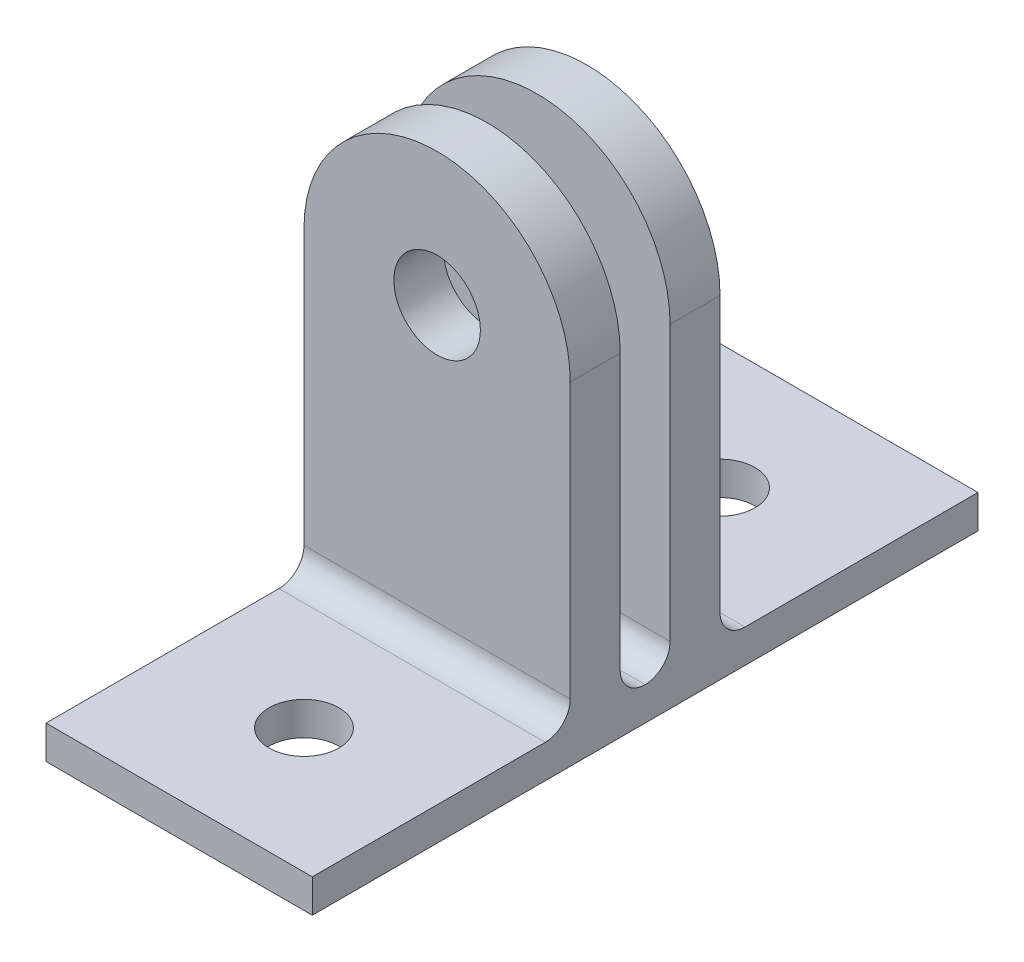
ISO-10303-21;
HEADER;
FILE_DESCRIPTION(('STEP AP214'),'2;1');
FILE_NAME('part.step','',(''),(''),'','','');
FILE_SCHEMA(('AUTOMOTIVE_DESIGN { 1 0 10303 214 1 1 1 1 }'));
ENDSEC;
DATA;
#1=APPLICATION_CONTEXT('core data for automotive mechanical design processes');
#2=APPLICATION_PROTOCOL_DEFINITION('international standard','automotive_design',2000,#1);
#3=PRODUCT_CONTEXT('',#1,'mechanical');
#4=PRODUCT('Part','Part','',(#3));
#5=PRODUCT_RELATED_PRODUCT_CATEGORY('part','',(#4));
#6=PRODUCT_DEFINITION_FORMATION('','',#4);
#7=PRODUCT_DEFINITION_CONTEXT('part definition',#1,'design');
#8=PRODUCT_DEFINITION('design','',#6,#7);
#9=PRODUCT_DEFINITION_SHAPE('','',#8);
#10=(LENGTH_UNIT() NAMED_UNIT(*) SI_UNIT(.MILLI.,.METRE.));
#11=(NAMED_UNIT(*) PLANE_ANGLE_UNIT() SI_UNIT($,.RADIAN.));
#12=(NAMED_UNIT(*) SI_UNIT($,.STERADIAN.) SOLID_ANGLE_UNIT());
#13=UNCERTAINTY_MEASURE_WITH_UNIT(LENGTH_MEASURE(1.E-05),#10,'distance_accuracy_value','');
#14=(GEOMETRIC_REPRESENTATION_CONTEXT(3) GLOBAL_UNCERTAINTY_ASSIGNED_CONTEXT((#13)) GLOBAL_UNIT_ASSIGNED_CONTEXT((#10,
#11,#12)) REPRESENTATION_CONTEXT('',''));
#15=CARTESIAN_POINT('',(0.,0.,0.));
#16=DIRECTION('',(0.,0.,1.));
#17=DIRECTION('',(1.,0.,0.));
#18=AXIS2_PLACEMENT_3D('',#15,#16,#17);
#19=CARTESIAN_POINT('',(0.,2.,0.));
#20=DIRECTION('',(0.,1.,0.));
#21=DIRECTION('',(0.,0.,1.));
#22=AXIS2_PLACEMENT_3D('',#19,#20,#21);
#23=PLANE('',#22);
#24=CARTESIAN_POINT('',(0.,2.,-12.5));
#25=DIRECTION('',(0.,1.,0.));
#26=DIRECTION('',(0.,0.,-1.));
#27=AXIS2_PLACEMENT_3D('',#24,#25,#26);
#28=CIRCLE('',#27,2.1);
#29=CARTESIAN_POINT('',(0.,2.,-14.6));
#30=VERTEX_POINT('',#29);
#31=EDGE_CURVE('E354',#30,#30,#28,.T.);
#32=ORIENTED_EDGE('',*,*,#31,.F.);
#33=EDGE_LOOP('',(#32));
#34=FACE_BOUND('',#33,.T.);
#35=DIRECTION('',(0.,0.,1.));
#36=VECTOR('',#35,1.);
#37=CARTESIAN_POINT('',(-8.,2.,20.));
#38=LINE('',#37,#36);
#39=CARTESIAN_POINT('',(-8.,2.,-20.));
#40=VERTEX_POINT('',#39);
#41=CARTESIAN_POINT('',(-8.,2.,-6.));
#42=VERTEX_POINT('',#41);
#43=EDGE_CURVE('E210',#40,#42,#38,.T.);
#44=ORIENTED_EDGE('',*,*,#43,.T.);
#45=DIRECTION('',(1.,0.,0.));
#46=VECTOR('',#45,1.);
#47=CARTESIAN_POINT('',(0.,2.,-6.));
#48=LINE('',#47,#46);
#49=CARTESIAN_POINT('',(8.,2.,-6.));
#50=VERTEX_POINT('',#49);
#51=EDGE_CURVE('E238',#42,#50,#48,.T.);
#52=ORIENTED_EDGE('',*,*,#51,.T.);
#53=DIRECTION('',(0.,0.,-1.));
#54=VECTOR('',#53,1.);
#55=CARTESIAN_POINT('',(8.,2.,-20.));
#56=LINE('',#55,#54);
#57=CARTESIAN_POINT('',(8.,2.,-20.));
#58=VERTEX_POINT('',#57);
#59=EDGE_CURVE('E207',#50,#58,#56,.T.);
#60=ORIENTED_EDGE('',*,*,#59,.T.);
#61=DIRECTION('',(-1.,0.,0.));
#62=VECTOR('',#61,1.);
#63=CARTESIAN_POINT('',(-8.,2.,-20.));
#64=LINE('',#63,#62);
#65=EDGE_CURVE('E206',#58,#40,#64,.T.);
#66=ORIENTED_EDGE('',*,*,#65,.T.);
#67=EDGE_LOOP('',(#44,#52,#60,#66));
#68=FACE_BOUND('',#67,.T.);
#69=ADVANCED_FACE('F35',(#34,#68),#23,.T.);
#70=CARTESIAN_POINT('',(8.,2.,-20.));
#71=DIRECTION('',(-1.,0.,0.));
#72=DIRECTION('',(0.,0.,1.));
#73=AXIS2_PLACEMENT_3D('',#70,#71,#72);
#74=PLANE('',#73);
#75=DIRECTION('',(0.,0.,-1.));
#76=VECTOR('',#75,1.);
#77=CARTESIAN_POINT('',(8.,0.,-20.));
#78=LINE('',#77,#76);
#79=CARTESIAN_POINT('',(8.,0.,20.));
#80=VERTEX_POINT('',#79);
#81=CARTESIAN_POINT('',(8.,0.,-20.));
#82=VERTEX_POINT('',#81);
#83=EDGE_CURVE('E202',#80,#82,#78,.T.);
#84=ORIENTED_EDGE('',*,*,#83,.T.);
#85=DIRECTION('',(0.,-1.,0.));
#86=VECTOR('',#85,1.);
#87=CARTESIAN_POINT('',(8.,2.,-20.));
#88=LINE('',#87,#86);
#89=EDGE_CURVE('E232',#58,#82,#88,.T.);
#90=ORIENTED_EDGE('',*,*,#89,.F.);
#91=ORIENTED_EDGE('',*,*,#59,.F.);
#92=CARTESIAN_POINT('',(8.,3.5,-6.));
#93=DIRECTION('',(-1.,0.,0.));
#94=DIRECTION('',(0.,0.,1.));
#95=AXIS2_PLACEMENT_3D('',#92,#93,#94);
#96=CIRCLE('',#95,1.5);
#97=CARTESIAN_POINT('',(8.,3.5,-4.5));
#98=VERTEX_POINT('',#97);
#99=EDGE_CURVE('E252',#50,#98,#96,.T.);
#100=ORIENTED_EDGE('',*,*,#99,.T.);
#101=DIRECTION('',(0.,1.,0.));
#102=VECTOR('',#101,1.);
#103=CARTESIAN_POINT('',(8.,20.,-4.5));
#104=LINE('',#103,#102);
#105=CARTESIAN_POINT('',(8.,20.,-4.5));
#106=VERTEX_POINT('',#105);
#107=EDGE_CURVE('E167',#98,#106,#104,.T.);
#108=ORIENTED_EDGE('',*,*,#107,.T.);
#109=DIRECTION('',(0.,0.,1.));
#110=VECTOR('',#109,1.);
#111=CARTESIAN_POINT('',(8.,20.,-4.5));
#112=LINE('',#111,#110);
#113=CARTESIAN_POINT('',(8.,20.,-1.5));
#114=VERTEX_POINT('',#113);
#115=EDGE_CURVE('E153',#106,#114,#112,.T.);
#116=ORIENTED_EDGE('',*,*,#115,.T.);
#117=DIRECTION('',(0.,1.,0.));
#118=VECTOR('',#117,1.);
#119=CARTESIAN_POINT('',(8.,20.,-1.5));
#120=LINE('',#119,#118);
#121=CARTESIAN_POINT('',(8.,3.5,-1.5));
#122=VERTEX_POINT('',#121);
#123=EDGE_CURVE('E162',#122,#114,#120,.T.);
#124=ORIENTED_EDGE('',*,*,#123,.F.);
#125=CARTESIAN_POINT('',(8.,3.5,0.));
#126=DIRECTION('',(-1.,0.,0.));
#127=DIRECTION('',(0.,0.,1.));
#128=AXIS2_PLACEMENT_3D('',#125,#126,#127);
#129=CIRCLE('',#128,1.5);
#130=CARTESIAN_POINT('',(8.,2.,0.));
#131=VERTEX_POINT('',#130);
#132=EDGE_CURVE('E57',#122,#131,#129,.T.);
#133=ORIENTED_EDGE('',*,*,#132,.T.);
#134=CARTESIAN_POINT('',(8.,3.5,0.));
#135=DIRECTION('',(-1.,0.,0.));
#136=DIRECTION('',(0.,0.,1.));
#137=AXIS2_PLACEMENT_3D('',#134,#135,#136);
#138=CIRCLE('',#137,1.5);
#139=CARTESIAN_POINT('',(8.,3.5,1.5));
#140=VERTEX_POINT('',#139);
#141=EDGE_CURVE('E44',#131,#140,#138,.T.);
#142=ORIENTED_EDGE('',*,*,#141,.T.);
#143=DIRECTION('',(0.,1.,0.));
#144=VECTOR('',#143,1.);
#145=CARTESIAN_POINT('',(8.,20.,1.5));
#146=LINE('',#145,#144);
#147=CARTESIAN_POINT('',(8.,20.,1.5));
#148=VERTEX_POINT('',#147);
#149=EDGE_CURVE('E194',#140,#148,#146,.T.);
#150=ORIENTED_EDGE('',*,*,#149,.T.);
#151=DIRECTION('',(0.,0.,-1.));
#152=VECTOR('',#151,1.);
#153=CARTESIAN_POINT('',(8.,20.,4.5));
#154=LINE('',#153,#152);
#155=CARTESIAN_POINT('',(8.,20.,4.5));
#156=VERTEX_POINT('',#155);
#157=EDGE_CURVE('E199',#156,#148,#154,.T.);
#158=ORIENTED_EDGE('',*,*,#157,.F.);
#159=DIRECTION('',(0.,1.,0.));
#160=VECTOR('',#159,1.);
#161=CARTESIAN_POINT('',(8.,20.,4.5));
#162=LINE('',#161,#160);
#163=CARTESIAN_POINT('',(8.,3.5,4.5));
#164=VERTEX_POINT('',#163);
#165=EDGE_CURVE('E187',#164,#156,#162,.T.);
#166=ORIENTED_EDGE('',*,*,#165,.F.);
#167=CARTESIAN_POINT('',(8.,3.5,6.));
#168=DIRECTION('',(-1.,0.,0.));
#169=DIRECTION('',(0.,0.,1.));
#170=AXIS2_PLACEMENT_3D('',#167,#168,#169);
#171=CIRCLE('',#170,1.5);
#172=CARTESIAN_POINT('',(8.,2.,6.));
#173=VERTEX_POINT('',#172);
#174=EDGE_CURVE('E256',#164,#173,#171,.T.);
#175=ORIENTED_EDGE('',*,*,#174,.T.);
#176=CARTESIAN_POINT('',(8.,2.,20.));
#177=VERTEX_POINT('',#176);
#178=EDGE_CURVE('E203',#177,#173,#56,.T.);
#179=ORIENTED_EDGE('',*,*,#178,.F.);
#180=DIRECTION('',(0.,-1.,0.));
#181=VECTOR('',#180,1.);
#182=CARTESIAN_POINT('',(8.,2.,20.));
#183=LINE('',#182,#181);
#184=EDGE_CURVE('E215',#177,#80,#183,.T.);
#185=ORIENTED_EDGE('',*,*,#184,.T.);
#186=EDGE_LOOP('',(#84,#90,#91,#100,#108,#116,#124,#133,#142,#150,#158,#166,#175,#179,#185));
#187=FACE_BOUND('',#186,.T.);
#188=ADVANCED_FACE('F261',(#187),#74,.F.);
#189=CARTESIAN_POINT('',(-8.,2.,-20.));
#190=DIRECTION('',(0.,0.,1.));
#191=DIRECTION('',(1.,0.,0.));
#192=AXIS2_PLACEMENT_3D('',#189,#190,#191);
#193=PLANE('',#192);
#194=DIRECTION('',(-1.,0.,0.));
#195=VECTOR('',#194,1.);
#196=CARTESIAN_POINT('',(-8.,0.,-20.));
#197=LINE('',#196,#195);
#198=CARTESIAN_POINT('',(-8.,0.,-20.));
#199=VERTEX_POINT('',#198);
#200=EDGE_CURVE('E218',#82,#199,#197,.T.);
#201=ORIENTED_EDGE('',*,*,#200,.T.);
#202=DIRECTION('',(0.,-1.,0.));
#203=VECTOR('',#202,1.);
#204=CARTESIAN_POINT('',(-8.,2.,-20.));
#205=LINE('',#204,#203);
#206=EDGE_CURVE('E229',#40,#199,#205,.T.);
#207=ORIENTED_EDGE('',*,*,#206,.F.);
#208=ORIENTED_EDGE('',*,*,#65,.F.);
#209=ORIENTED_EDGE('',*,*,#89,.T.);
#210=EDGE_LOOP('',(#201,#207,#208,#209));
#211=FACE_BOUND('',#210,.T.);
#212=ADVANCED_FACE('F290',(#211),#193,.F.);
#213=CARTESIAN_POINT('',(-8.,2.,20.));
#214=DIRECTION('',(1.,0.,0.));
#215=DIRECTION('',(0.,0.,-1.));
#216=AXIS2_PLACEMENT_3D('',#213,#214,#215);
#217=PLANE('',#216);
#218=DIRECTION('',(0.,0.,1.));
#219=VECTOR('',#218,1.);
#220=CARTESIAN_POINT('',(-8.,0.,20.));
#221=LINE('',#220,#219);
#222=CARTESIAN_POINT('',(-8.,0.,20.));
#223=VERTEX_POINT('',#222);
#224=EDGE_CURVE('E220',#199,#223,#221,.T.);
#225=ORIENTED_EDGE('',*,*,#224,.T.);
#226=DIRECTION('',(0.,-1.,0.));
#227=VECTOR('',#226,1.);
#228=CARTESIAN_POINT('',(-8.,2.,20.));
#229=LINE('',#228,#227);
#230=CARTESIAN_POINT('',(-8.,2.,20.));
#231=VERTEX_POINT('',#230);
#232=EDGE_CURVE('E226',#231,#223,#229,.T.);
#233=ORIENTED_EDGE('',*,*,#232,.F.);
#234=CARTESIAN_POINT('',(-8.,2.,6.));
#235=VERTEX_POINT('',#234);
#236=EDGE_CURVE('E209',#235,#231,#38,.T.);
#237=ORIENTED_EDGE('',*,*,#236,.F.);
#238=CARTESIAN_POINT('',(-8.,3.5,6.));
#239=DIRECTION('',(1.,0.,0.));
#240=DIRECTION('',(0.,0.,-1.));
#241=AXIS2_PLACEMENT_3D('',#238,#239,#240);
#242=CIRCLE('',#241,1.5);
#243=CARTESIAN_POINT('',(-8.,3.5,4.5));
#244=VERTEX_POINT('',#243);
#245=EDGE_CURVE('E258',#235,#244,#242,.T.);
#246=ORIENTED_EDGE('',*,*,#245,.T.);
#247=DIRECTION('',(0.,-1.,0.));
#248=VECTOR('',#247,1.);
#249=CARTESIAN_POINT('',(-8.,20.,4.5));
#250=LINE('',#249,#248);
#251=CARTESIAN_POINT('',(-8.,20.,4.5));
#252=VERTEX_POINT('',#251);
#253=EDGE_CURVE('E184',#252,#244,#250,.T.);
#254=ORIENTED_EDGE('',*,*,#253,.F.);
#255=DIRECTION('',(0.,0.,-1.));
#256=VECTOR('',#255,1.);
#257=CARTESIAN_POINT('',(-8.,20.,4.5));
#258=LINE('',#257,#256);
#259=CARTESIAN_POINT('',(-8.,20.,1.5));
#260=VERTEX_POINT('',#259);
#261=EDGE_CURVE('E192',#252,#260,#258,.T.);
#262=ORIENTED_EDGE('',*,*,#261,.T.);
#263=DIRECTION('',(0.,-1.,0.));
#264=VECTOR('',#263,1.);
#265=CARTESIAN_POINT('',(-8.,20.,1.5));
#266=LINE('',#265,#264);
#267=CARTESIAN_POINT('',(-8.,3.5,1.5));
#268=VERTEX_POINT('',#267);
#269=EDGE_CURVE('E181',#260,#268,#266,.T.);
#270=ORIENTED_EDGE('',*,*,#269,.T.);
#271=CARTESIAN_POINT('',(-8.,3.5,0.));
#272=DIRECTION('',(1.,0.,0.));
#273=DIRECTION('',(0.,0.,-1.));
#274=AXIS2_PLACEMENT_3D('',#271,#272,#273);
#275=CIRCLE('',#274,1.5);
#276=CARTESIAN_POINT('',(-8.,2.,0.));
#277=VERTEX_POINT('',#276);
#278=EDGE_CURVE('E11',#268,#277,#275,.T.);
#279=ORIENTED_EDGE('',*,*,#278,.T.);
#280=CARTESIAN_POINT('',(-8.,3.5,0.));
#281=DIRECTION('',(1.,0.,0.));
#282=DIRECTION('',(0.,0.,-1.));
#283=AXIS2_PLACEMENT_3D('',#280,#281,#282);
#284=CIRCLE('',#283,1.5);
#285=CARTESIAN_POINT('',(-8.,3.5,-1.5));
#286=VERTEX_POINT('',#285);
#287=EDGE_CURVE('E250',#277,#286,#284,.T.);
#288=ORIENTED_EDGE('',*,*,#287,.T.);
#289=DIRECTION('',(0.,-1.,0.));
#290=VECTOR('',#289,1.);
#291=CARTESIAN_POINT('',(-8.,20.,-1.5));
#292=LINE('',#291,#290);
#293=CARTESIAN_POINT('',(-8.,20.,-1.5));
#294=VERTEX_POINT('',#293);
#295=EDGE_CURVE('E147',#294,#286,#292,.T.);
#296=ORIENTED_EDGE('',*,*,#295,.F.);
#297=DIRECTION('',(0.,0.,1.));
#298=VECTOR('',#297,1.);
#299=CARTESIAN_POINT('',(-8.,20.,-4.5));
#300=LINE('',#299,#298);
#301=CARTESIAN_POINT('',(-8.,20.,-4.5));
#302=VERTEX_POINT('',#301);
#303=EDGE_CURVE('E141',#302,#294,#300,.T.);
#304=ORIENTED_EDGE('',*,*,#303,.F.);
#305=DIRECTION('',(0.,-1.,0.));
#306=VECTOR('',#305,1.);
#307=CARTESIAN_POINT('',(-8.,20.,-4.5));
#308=LINE('',#307,#306);
#309=CARTESIAN_POINT('',(-8.,3.5,-4.5));
#310=VERTEX_POINT('',#309);
#311=EDGE_CURVE('E144',#302,#310,#308,.T.);
#312=ORIENTED_EDGE('',*,*,#311,.T.);
#313=CARTESIAN_POINT('',(-8.,3.5,-6.));
#314=DIRECTION('',(1.,0.,0.));
#315=DIRECTION('',(0.,0.,-1.));
#316=AXIS2_PLACEMENT_3D('',#313,#314,#315);
#317=CIRCLE('',#316,1.5);
#318=EDGE_CURVE('E254',#310,#42,#317,.T.);
#319=ORIENTED_EDGE('',*,*,#318,.T.);
#320=ORIENTED_EDGE('',*,*,#43,.F.);
#321=ORIENTED_EDGE('',*,*,#206,.T.);
#322=EDGE_LOOP('',(#225,#233,#237,#246,#254,#262,#270,#279,#288,#296,#304,#312,#319,#320,#321));
#323=FACE_BOUND('',#322,.T.);
#324=ADVANCED_FACE('F143',(#323),#217,.F.);
#325=CARTESIAN_POINT('',(-8.,2.,20.));
#326=DIRECTION('',(0.,0.,-1.));
#327=DIRECTION('',(-1.,0.,0.));
#328=AXIS2_PLACEMENT_3D('',#325,#326,#327);
#329=PLANE('',#328);
#330=DIRECTION('',(1.,0.,0.));
#331=VECTOR('',#330,1.);
#332=CARTESIAN_POINT('',(-8.,0.,20.));
#333=LINE('',#332,#331);
#334=EDGE_CURVE('E222',#223,#80,#333,.T.);
#335=ORIENTED_EDGE('',*,*,#334,.T.);
#336=ORIENTED_EDGE('',*,*,#184,.F.);
#337=DIRECTION('',(1.,0.,0.));
#338=VECTOR('',#337,1.);
#339=CARTESIAN_POINT('',(-8.,2.,20.));
#340=LINE('',#339,#338);
#341=EDGE_CURVE('E213',#231,#177,#340,.T.);
#342=ORIENTED_EDGE('',*,*,#341,.F.);
#343=ORIENTED_EDGE('',*,*,#232,.T.);
#344=EDGE_LOOP('',(#335,#336,#342,#343));
#345=FACE_BOUND('',#344,.T.);
#346=ADVANCED_FACE('F299',(#345),#329,.F.);
#347=CARTESIAN_POINT('',(0.,2.,12.5));
#348=DIRECTION('',(0.,1.,0.));
#349=DIRECTION('',(0.,0.,1.));
#350=AXIS2_PLACEMENT_3D('',#347,#348,#349);
#351=CIRCLE('',#350,2.1);
#352=CARTESIAN_POINT('',(0.,2.,14.6));
#353=VERTEX_POINT('',#352);
#354=EDGE_CURVE('E347',#353,#353,#351,.T.);
#355=ORIENTED_EDGE('',*,*,#354,.F.);
#356=EDGE_LOOP('',(#355));
#357=FACE_BOUND('',#356,.T.);
#358=ORIENTED_EDGE('',*,*,#178,.T.);
#359=DIRECTION('',(1.,0.,0.));
#360=VECTOR('',#359,1.);
#361=CARTESIAN_POINT('',(0.,2.,6.));
#362=LINE('',#361,#360);
#363=EDGE_CURVE('E245',#173,#235,#362,.F.);
#364=ORIENTED_EDGE('',*,*,#363,.T.);
#365=ORIENTED_EDGE('',*,*,#236,.T.);
#366=ORIENTED_EDGE('',*,*,#341,.T.);
#367=EDGE_LOOP('',(#358,#364,#365,#366));
#368=FACE_BOUND('',#367,.T.);
#369=ADVANCED_FACE('F305',(#357,#368),#23,.T.);
#370=CARTESIAN_POINT('',(0.,0.,0.));
#371=DIRECTION('',(0.,1.,0.));
#372=DIRECTION('',(0.,0.,1.));
#373=AXIS2_PLACEMENT_3D('',#370,#371,#372);
#374=PLANE('',#373);
#375=CARTESIAN_POINT('',(0.,0.,-12.5));
#376=DIRECTION('',(0.,1.,0.));
#377=DIRECTION('',(0.,0.,-1.));
#378=AXIS2_PLACEMENT_3D('',#375,#376,#377);
#379=CIRCLE('',#378,2.1);
#380=CARTESIAN_POINT('',(0.,0.,-14.6));
#381=VERTEX_POINT('',#380);
#382=EDGE_CURVE('E349',#381,#381,#379,.T.);
#383=ORIENTED_EDGE('',*,*,#382,.T.);
#384=EDGE_LOOP('',(#383));
#385=FACE_BOUND('',#384,.T.);
#386=CARTESIAN_POINT('',(0.,0.,12.5));
#387=DIRECTION('',(0.,1.,0.));
#388=DIRECTION('',(0.,0.,1.));
#389=AXIS2_PLACEMENT_3D('',#386,#387,#388);
#390=CIRCLE('',#389,2.1);
#391=CARTESIAN_POINT('',(0.,0.,14.6));
#392=VERTEX_POINT('',#391);
#393=EDGE_CURVE('E275',#392,#392,#390,.T.);
#394=ORIENTED_EDGE('',*,*,#393,.T.);
#395=EDGE_LOOP('',(#394));
#396=FACE_BOUND('',#395,.T.);
#397=ORIENTED_EDGE('',*,*,#83,.F.);
#398=ORIENTED_EDGE('',*,*,#334,.F.);
#399=ORIENTED_EDGE('',*,*,#224,.F.);
#400=ORIENTED_EDGE('',*,*,#200,.F.);
#401=EDGE_LOOP('',(#397,#398,#399,#400));
#402=FACE_BOUND('',#401,.T.);
#403=ADVANCED_FACE('F296',(#385,#396,#402),#374,.F.);
#404=CARTESIAN_POINT('',(0.,20.,4.5));
#405=DIRECTION('',(0.,0.,-1.));
#406=DIRECTION('',(-1.,0.,0.));
#407=AXIS2_PLACEMENT_3D('',#404,#405,#406);
#408=PLANE('',#407);
#409=ORIENTED_EDGE('',*,*,#253,.T.);
#410=DIRECTION('',(1.,0.,0.));
#411=VECTOR('',#410,1.);
#412=CARTESIAN_POINT('',(0.,3.5,4.5));
#413=LINE('',#412,#411);
#414=EDGE_CURVE('E242',#244,#164,#413,.T.);
#415=ORIENTED_EDGE('',*,*,#414,.T.);
#416=ORIENTED_EDGE('',*,*,#165,.T.);
#417=CARTESIAN_POINT('',(0.,20.,4.5));
#418=DIRECTION('',(0.,0.,1.));
#419=DIRECTION('',(-1.,0.,0.));
#420=AXIS2_PLACEMENT_3D('',#417,#418,#419);
#421=CIRCLE('',#420,8.);
#422=EDGE_CURVE('E190',#156,#252,#421,.T.);
#423=ORIENTED_EDGE('',*,*,#422,.T.);
#424=EDGE_LOOP('',(#409,#415,#416,#423));
#425=FACE_BOUND('',#424,.T.);
#426=CARTESIAN_POINT('',(0.,20.,4.5));
#427=DIRECTION('',(0.,0.,1.));
#428=DIRECTION('',(1.,0.,0.));
#429=AXIS2_PLACEMENT_3D('',#426,#427,#428);
#430=CIRCLE('',#429,2.6);
#431=CARTESIAN_POINT('',(2.6,20.,4.5));
#432=VERTEX_POINT('',#431);
#433=EDGE_CURVE('E178',#432,#432,#430,.T.);
#434=ORIENTED_EDGE('',*,*,#433,.F.);
#435=EDGE_LOOP('',(#434));
#436=FACE_BOUND('',#435,.T.);
#437=ADVANCED_FACE('F312',(#425,#436),#408,.F.);
#438=CARTESIAN_POINT('',(0.,20.,1.5));
#439=DIRECTION('',(0.,0.,-1.));
#440=DIRECTION('',(-1.,0.,0.));
#441=AXIS2_PLACEMENT_3D('',#438,#439,#440);
#442=PLANE('',#441);
#443=ORIENTED_EDGE('',*,*,#149,.F.);
#444=DIRECTION('',(1.,0.,0.));
#445=VECTOR('',#444,1.);
#446=CARTESIAN_POINT('',(-8.,3.5,1.5));
#447=LINE('',#446,#445);
#448=EDGE_CURVE('E247',#140,#268,#447,.F.);
#449=ORIENTED_EDGE('',*,*,#448,.T.);
#450=ORIENTED_EDGE('',*,*,#269,.F.);
#451=CARTESIAN_POINT('',(0.,20.,1.5));
#452=DIRECTION('',(0.,0.,1.));
#453=DIRECTION('',(-1.,0.,0.));
#454=AXIS2_PLACEMENT_3D('',#451,#452,#453);
#455=CIRCLE('',#454,8.);
#456=EDGE_CURVE('E188',#148,#260,#455,.T.);
#457=ORIENTED_EDGE('',*,*,#456,.F.);
#458=EDGE_LOOP('',(#443,#449,#450,#457));
#459=FACE_BOUND('',#458,.T.);
#460=CARTESIAN_POINT('',(0.,20.,1.5));
#461=DIRECTION('',(0.,0.,1.));
#462=DIRECTION('',(1.,0.,0.));
#463=AXIS2_PLACEMENT_3D('',#460,#461,#462);
#464=CIRCLE('',#463,2.6);
#465=CARTESIAN_POINT('',(2.6,20.,1.5));
#466=VERTEX_POINT('',#465);
#467=EDGE_CURVE('E152',#466,#466,#464,.T.);
#468=ORIENTED_EDGE('',*,*,#467,.T.);
#469=EDGE_LOOP('',(#468));
#470=FACE_BOUND('',#469,.T.);
#471=ADVANCED_FACE('F268',(#459,#470),#442,.T.);
#472=CARTESIAN_POINT('',(0.,20.,4.5));
#473=DIRECTION('',(0.,0.,-1.));
#474=DIRECTION('',(-1.,0.,0.));
#475=AXIS2_PLACEMENT_3D('',#472,#473,#474);
#476=CYLINDRICAL_SURFACE('',#475,8.);
#477=ORIENTED_EDGE('',*,*,#456,.T.);
#478=ORIENTED_EDGE('',*,*,#261,.F.);
#479=ORIENTED_EDGE('',*,*,#422,.F.);
#480=ORIENTED_EDGE('',*,*,#157,.T.);
#481=EDGE_LOOP('',(#477,#478,#479,#480));
#482=FACE_BOUND('',#481,.T.);
#483=ADVANCED_FACE('F317',(#482),#476,.T.);
#484=CARTESIAN_POINT('',(0.,20.,4.5));
#485=DIRECTION('',(0.,0.,-1.));
#486=DIRECTION('',(-1.,0.,0.));
#487=AXIS2_PLACEMENT_3D('',#484,#485,#486);
#488=CYLINDRICAL_SURFACE('',#487,2.6);
#489=ORIENTED_EDGE('',*,*,#433,.T.);
#490=EDGE_LOOP('',(#489));
#491=FACE_BOUND('',#490,.T.);
#492=ORIENTED_EDGE('',*,*,#467,.F.);
#493=EDGE_LOOP('',(#492));
#494=FACE_BOUND('',#493,.T.);
#495=ADVANCED_FACE('F319',(#491,#494),#488,.F.);
#496=CARTESIAN_POINT('',(0.,20.,-4.5));
#497=DIRECTION('',(0.,0.,1.));
#498=DIRECTION('',(1.,0.,0.));
#499=AXIS2_PLACEMENT_3D('',#496,#497,#498);
#500=CYLINDRICAL_SURFACE('',#499,8.);
#501=CARTESIAN_POINT('',(0.,20.,-1.5));
#502=DIRECTION('',(0.,0.,1.));
#503=DIRECTION('',(-1.,0.,0.));
#504=AXIS2_PLACEMENT_3D('',#501,#502,#503);
#505=CIRCLE('',#504,8.);
#506=EDGE_CURVE('E173',#114,#294,#505,.T.);
#507=ORIENTED_EDGE('',*,*,#506,.F.);
#508=ORIENTED_EDGE('',*,*,#115,.F.);
#509=CARTESIAN_POINT('',(0.,20.,-4.5));
#510=DIRECTION('',(0.,0.,1.));
#511=DIRECTION('',(-1.,0.,0.));
#512=AXIS2_PLACEMENT_3D('',#509,#510,#511);
#513=CIRCLE('',#512,8.);
#514=EDGE_CURVE('E159',#106,#302,#513,.T.);
#515=ORIENTED_EDGE('',*,*,#514,.T.);
#516=ORIENTED_EDGE('',*,*,#303,.T.);
#517=EDGE_LOOP('',(#507,#508,#515,#516));
#518=FACE_BOUND('',#517,.T.);
#519=ADVANCED_FACE('F165',(#518),#500,.T.);
#520=CARTESIAN_POINT('',(0.,20.,-4.5));
#521=DIRECTION('',(0.,0.,1.));
#522=DIRECTION('',(-1.,0.,0.));
#523=AXIS2_PLACEMENT_3D('',#520,#521,#522);
#524=PLANE('',#523);
#525=CARTESIAN_POINT('',(0.,20.,-4.5));
#526=DIRECTION('',(0.,0.,1.));
#527=DIRECTION('',(1.,0.,0.));
#528=AXIS2_PLACEMENT_3D('',#525,#526,#527);
#529=CIRCLE('',#528,2.6);
#530=CARTESIAN_POINT('',(2.6,20.,-4.5));
#531=VERTEX_POINT('',#530);
#532=EDGE_CURVE('E174',#531,#531,#529,.T.);
#533=ORIENTED_EDGE('',*,*,#532,.T.);
#534=EDGE_LOOP('',(#533));
#535=FACE_BOUND('',#534,.T.);
#536=ORIENTED_EDGE('',*,*,#107,.F.);
#537=DIRECTION('',(1.,0.,0.));
#538=VECTOR('',#537,1.);
#539=CARTESIAN_POINT('',(0.,3.5,-4.5));
#540=LINE('',#539,#538);
#541=EDGE_CURVE('E161',#98,#310,#540,.F.);
#542=ORIENTED_EDGE('',*,*,#541,.T.);
#543=ORIENTED_EDGE('',*,*,#311,.F.);
#544=ORIENTED_EDGE('',*,*,#514,.F.);
#545=EDGE_LOOP('',(#536,#542,#543,#544));
#546=FACE_BOUND('',#545,.T.);
#547=ADVANCED_FACE('F158',(#535,#546),#524,.F.);
#548=CARTESIAN_POINT('',(0.,20.,-1.5));
#549=DIRECTION('',(0.,0.,1.));
#550=DIRECTION('',(-1.,0.,0.));
#551=AXIS2_PLACEMENT_3D('',#548,#549,#550);
#552=PLANE('',#551);
#553=CARTESIAN_POINT('',(0.,20.,-1.5));
#554=DIRECTION('',(0.,0.,1.));
#555=DIRECTION('',(1.,0.,0.));
#556=AXIS2_PLACEMENT_3D('',#553,#554,#555);
#557=CIRCLE('',#556,2.6);
#558=CARTESIAN_POINT('',(2.6,20.,-1.5));
#559=VERTEX_POINT('',#558);
#560=EDGE_CURVE('E274',#559,#559,#557,.T.);
#561=ORIENTED_EDGE('',*,*,#560,.F.);
#562=EDGE_LOOP('',(#561));
#563=FACE_BOUND('',#562,.T.);
#564=ORIENTED_EDGE('',*,*,#295,.T.);
#565=DIRECTION('',(1.,0.,0.));
#566=VECTOR('',#565,1.);
#567=CARTESIAN_POINT('',(8.,3.5,-1.5));
#568=LINE('',#567,#566);
#569=EDGE_CURVE('E235',#286,#122,#568,.T.);
#570=ORIENTED_EDGE('',*,*,#569,.T.);
#571=ORIENTED_EDGE('',*,*,#123,.T.);
#572=ORIENTED_EDGE('',*,*,#506,.T.);
#573=EDGE_LOOP('',(#564,#570,#571,#572));
#574=FACE_BOUND('',#573,.T.);
#575=ADVANCED_FACE('F279',(#563,#574),#552,.T.);
#576=CARTESIAN_POINT('',(0.,20.,-4.5));
#577=DIRECTION('',(0.,0.,1.));
#578=DIRECTION('',(1.,0.,0.));
#579=AXIS2_PLACEMENT_3D('',#576,#577,#578);
#580=CYLINDRICAL_SURFACE('',#579,2.6);
#581=ORIENTED_EDGE('',*,*,#532,.F.);
#582=EDGE_LOOP('',(#581));
#583=FACE_BOUND('',#582,.T.);
#584=ORIENTED_EDGE('',*,*,#560,.T.);
#585=EDGE_LOOP('',(#584));
#586=FACE_BOUND('',#585,.T.);
#587=ADVANCED_FACE('F362',(#583,#586),#580,.F.);
#588=CARTESIAN_POINT('',(0.,3.5,0.));
#589=DIRECTION('',(-1.,0.,0.));
#590=DIRECTION('',(0.,0.,1.));
#591=AXIS2_PLACEMENT_3D('',#588,#589,#590);
#592=CYLINDRICAL_SURFACE('',#591,1.5);
#593=DIRECTION('',(1.,0.,0.));
#594=VECTOR('',#593,1.);
#595=CARTESIAN_POINT('',(8.,2.,0.));
#596=LINE('',#595,#594);
#597=EDGE_CURVE('E39',#277,#131,#596,.T.);
#598=ORIENTED_EDGE('',*,*,#597,.F.);
#599=ORIENTED_EDGE('',*,*,#278,.F.);
#600=ORIENTED_EDGE('',*,*,#448,.F.);
#601=ORIENTED_EDGE('',*,*,#141,.F.);
#602=EDGE_LOOP('',(#598,#599,#600,#601));
#603=FACE_BOUND('',#602,.T.);
#604=ADVANCED_FACE('F271',(#603),#592,.F.);
#605=CARTESIAN_POINT('',(0.,3.5,0.));
#606=DIRECTION('',(-1.,0.,0.));
#607=DIRECTION('',(0.,0.,1.));
#608=AXIS2_PLACEMENT_3D('',#605,#606,#607);
#609=CYLINDRICAL_SURFACE('',#608,1.5);
#610=ORIENTED_EDGE('',*,*,#287,.F.);
#611=ORIENTED_EDGE('',*,*,#597,.T.);
#612=ORIENTED_EDGE('',*,*,#132,.F.);
#613=ORIENTED_EDGE('',*,*,#569,.F.);
#614=EDGE_LOOP('',(#610,#611,#612,#613));
#615=FACE_BOUND('',#614,.T.);
#616=ADVANCED_FACE('F277',(#615),#609,.F.);
#617=CARTESIAN_POINT('',(0.,3.5,-6.));
#618=DIRECTION('',(1.,0.,0.));
#619=DIRECTION('',(0.,0.,-1.));
#620=AXIS2_PLACEMENT_3D('',#617,#618,#619);
#621=CYLINDRICAL_SURFACE('',#620,1.5);
#622=ORIENTED_EDGE('',*,*,#318,.F.);
#623=ORIENTED_EDGE('',*,*,#541,.F.);
#624=ORIENTED_EDGE('',*,*,#99,.F.);
#625=ORIENTED_EDGE('',*,*,#51,.F.);
#626=EDGE_LOOP('',(#622,#623,#624,#625));
#627=FACE_BOUND('',#626,.T.);
#628=ADVANCED_FACE('F282',(#627),#621,.F.);
#629=CARTESIAN_POINT('',(0.,3.5,6.));
#630=DIRECTION('',(1.,0.,0.));
#631=DIRECTION('',(0.,0.,-1.));
#632=AXIS2_PLACEMENT_3D('',#629,#630,#631);
#633=CYLINDRICAL_SURFACE('',#632,1.5);
#634=ORIENTED_EDGE('',*,*,#245,.F.);
#635=ORIENTED_EDGE('',*,*,#363,.F.);
#636=ORIENTED_EDGE('',*,*,#174,.F.);
#637=ORIENTED_EDGE('',*,*,#414,.F.);
#638=EDGE_LOOP('',(#634,#635,#636,#637));
#639=FACE_BOUND('',#638,.T.);
#640=ADVANCED_FACE('F37',(#639),#633,.F.);
#641=CARTESIAN_POINT('',(0.,0.,12.5));
#642=DIRECTION('',(0.,1.,0.));
#643=DIRECTION('',(0.,0.,1.));
#644=AXIS2_PLACEMENT_3D('',#641,#642,#643);
#645=CYLINDRICAL_SURFACE('',#644,2.1);
#646=ORIENTED_EDGE('',*,*,#393,.F.);
#647=EDGE_LOOP('',(#646));
#648=FACE_BOUND('',#647,.T.);
#649=ORIENTED_EDGE('',*,*,#354,.T.);
#650=EDGE_LOOP('',(#649));
#651=FACE_BOUND('',#650,.T.);
#652=ADVANCED_FACE('F431',(#648,#651),#645,.F.);
#653=CARTESIAN_POINT('',(0.,0.,-12.5));
#654=DIRECTION('',(0.,1.,0.));
#655=DIRECTION('',(0.,0.,1.));
#656=AXIS2_PLACEMENT_3D('',#653,#654,#655);
#657=CYLINDRICAL_SURFACE('',#656,2.1);
#658=ORIENTED_EDGE('',*,*,#382,.F.);
#659=EDGE_LOOP('',(#658));
#660=FACE_BOUND('',#659,.T.);
#661=ORIENTED_EDGE('',*,*,#31,.T.);
#662=EDGE_LOOP('',(#661));
#663=FACE_BOUND('',#662,.T.);
#664=ADVANCED_FACE('F456',(#660,#663),#657,.F.);
#665=CLOSED_SHELL('',(#69,#188,#212,#324,#346,#369,#403,#437,#471,#483,#495,#519,#547,#575,#587,
#604,#616,#628,#640,#652,#664));
#666=MANIFOLD_SOLID_BREP('B2',#665);
#667=ADVANCED_BREP_SHAPE_REPRESENTATION('',(#18,#666),#14);
#668=SHAPE_DEFINITION_REPRESENTATION(#9,#667);
ENDSEC;
END-ISO-10303-21;
